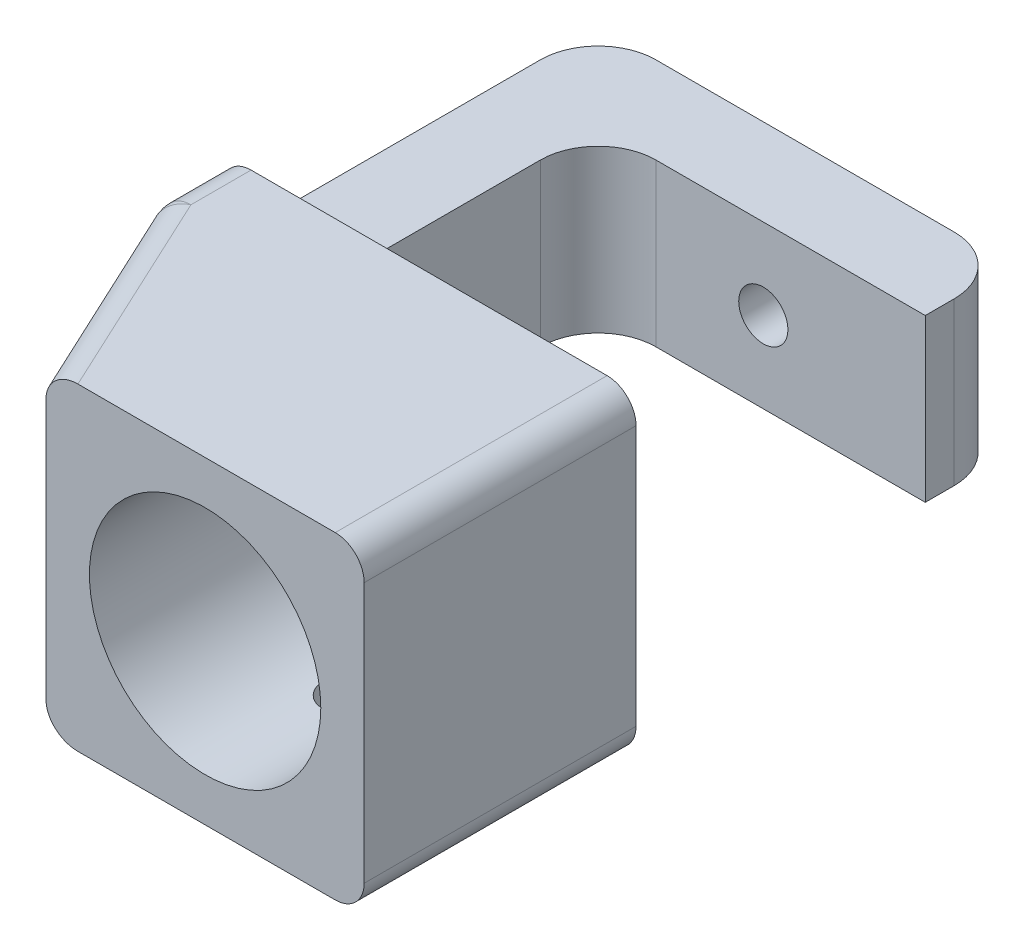
ISO-10303-21;
HEADER;
FILE_DESCRIPTION(('STEP AP214'),'2;1');
FILE_NAME('part.step','',(''),(''),'','','');
FILE_SCHEMA(('AUTOMOTIVE_DESIGN { 1 0 10303 214 1 1 1 1 }'));
ENDSEC;
DATA;
#1=APPLICATION_CONTEXT('core data for automotive mechanical design processes');
#2=APPLICATION_PROTOCOL_DEFINITION('international standard','automotive_design',2000,#1);
#3=PRODUCT_CONTEXT('',#1,'mechanical');
#4=PRODUCT('Part','Part','',(#3));
#5=PRODUCT_RELATED_PRODUCT_CATEGORY('part','',(#4));
#6=PRODUCT_DEFINITION_FORMATION('','',#4);
#7=PRODUCT_DEFINITION_CONTEXT('part definition',#1,'design');
#8=PRODUCT_DEFINITION('design','',#6,#7);
#9=PRODUCT_DEFINITION_SHAPE('','',#8);
#10=(LENGTH_UNIT() NAMED_UNIT(*) SI_UNIT(.MILLI.,.METRE.));
#11=(NAMED_UNIT(*) PLANE_ANGLE_UNIT() SI_UNIT($,.RADIAN.));
#12=(NAMED_UNIT(*) SI_UNIT($,.STERADIAN.) SOLID_ANGLE_UNIT());
#13=UNCERTAINTY_MEASURE_WITH_UNIT(LENGTH_MEASURE(1.E-05),#10,'distance_accuracy_value','');
#14=(GEOMETRIC_REPRESENTATION_CONTEXT(3) GLOBAL_UNCERTAINTY_ASSIGNED_CONTEXT((#13)) GLOBAL_UNIT_ASSIGNED_CONTEXT((#10,
#11,#12)) REPRESENTATION_CONTEXT('',''));
#15=CARTESIAN_POINT('',(0.,0.,0.));
#16=DIRECTION('',(0.,0.,1.));
#17=DIRECTION('',(1.,0.,0.));
#18=AXIS2_PLACEMENT_3D('',#15,#16,#17);
#19=CARTESIAN_POINT('',(8.9715256437763,41.5,65.2434779334417));
#20=DIRECTION('',(0.,1.,0.));
#21=DIRECTION('',(0.,0.,1.));
#22=AXIS2_PLACEMENT_3D('',#19,#20,#21);
#23=PLANE('',#22);
#24=DIRECTION('',(0.,0.,-1.));
#25=VECTOR('',#24,1.);
#26=CARTESIAN_POINT('',(67.55,41.5,65.2434779334417));
#27=LINE('',#26,#25);
#28=CARTESIAN_POINT('',(67.55,41.5,15.));
#29=VERTEX_POINT('',#28);
#30=CARTESIAN_POINT('',(67.55,41.5,10.));
#31=VERTEX_POINT('',#30);
#32=EDGE_CURVE('E229',#29,#31,#27,.T.);
#33=ORIENTED_EDGE('',*,*,#32,.T.);
#34=CARTESIAN_POINT('',(57.55,41.5,10.));
#35=DIRECTION('',(0.,1.,0.));
#36=DIRECTION('',(0.,0.,1.));
#37=AXIS2_PLACEMENT_3D('',#34,#35,#36);
#38=CIRCLE('',#37,10.);
#39=CARTESIAN_POINT('',(57.55,41.5,0.));
#40=VERTEX_POINT('',#39);
#41=EDGE_CURVE('E12',#31,#40,#38,.T.);
#42=ORIENTED_EDGE('',*,*,#41,.T.);
#43=DIRECTION('',(1.,0.,0.));
#44=VECTOR('',#43,1.);
#45=CARTESIAN_POINT('',(8.9715256437763,41.5,0.));
#46=LINE('',#45,#44);
#47=CARTESIAN_POINT('',(6.,41.5,0.));
#48=VERTEX_POINT('',#47);
#49=EDGE_CURVE('E204',#40,#48,#46,.F.);
#50=ORIENTED_EDGE('',*,*,#49,.T.);
#51=CARTESIAN_POINT('',(6.,41.5,10.));
#52=DIRECTION('',(0.,1.,0.));
#53=DIRECTION('',(0.,0.,1.));
#54=AXIS2_PLACEMENT_3D('',#51,#52,#53);
#55=CIRCLE('',#54,10.);
#56=CARTESIAN_POINT('',(-4.,41.5,10.));
#57=VERTEX_POINT('',#56);
#58=EDGE_CURVE('E199',#48,#57,#55,.T.);
#59=ORIENTED_EDGE('',*,*,#58,.T.);
#60=DIRECTION('',(0.,0.,1.));
#61=VECTOR('',#60,1.);
#62=CARTESIAN_POINT('',(-3.99999999999999,41.5,65.2434779334417));
#63=LINE('',#62,#61);
#64=CARTESIAN_POINT('',(-3.99999999999999,41.5,65.));
#65=VERTEX_POINT('',#64);
#66=EDGE_CURVE('E197',#57,#65,#63,.T.);
#67=ORIENTED_EDGE('',*,*,#66,.T.);
#68=DIRECTION('',(-1.,0.,0.));
#69=VECTOR('',#68,1.);
#70=CARTESIAN_POINT('',(17.8187221300504,41.5,65.));
#71=LINE('',#70,#69);
#72=CARTESIAN_POINT('',(21.,41.5,65.));
#73=VERTEX_POINT('',#72);
#74=EDGE_CURVE('E184',#73,#65,#71,.T.);
#75=ORIENTED_EDGE('',*,*,#74,.F.);
#76=CARTESIAN_POINT('',(21.,41.5,55.));
#77=DIRECTION('',(0.,1.,0.));
#78=DIRECTION('',(0.,0.,1.));
#79=AXIS2_PLACEMENT_3D('',#76,#77,#78);
#80=CIRCLE('',#79,10.);
#81=CARTESIAN_POINT('',(11.,41.5,55.));
#82=VERTEX_POINT('',#81);
#83=EDGE_CURVE('E267',#73,#82,#80,.F.);
#84=ORIENTED_EDGE('',*,*,#83,.T.);
#85=DIRECTION('',(0.,0.,1.));
#86=VECTOR('',#85,1.);
#87=CARTESIAN_POINT('',(11.,41.5,65.2434779334417));
#88=LINE('',#87,#86);
#89=CARTESIAN_POINT('',(11.,41.5,25.));
#90=VERTEX_POINT('',#89);
#91=EDGE_CURVE('E232',#82,#90,#88,.F.);
#92=ORIENTED_EDGE('',*,*,#91,.T.);
#93=CARTESIAN_POINT('',(21.,41.5,25.));
#94=DIRECTION('',(0.,1.,0.));
#95=DIRECTION('',(0.,0.,1.));
#96=AXIS2_PLACEMENT_3D('',#93,#94,#95);
#97=CIRCLE('',#96,10.);
#98=CARTESIAN_POINT('',(21.,41.5,15.));
#99=VERTEX_POINT('',#98);
#100=EDGE_CURVE('E272',#90,#99,#97,.F.);
#101=ORIENTED_EDGE('',*,*,#100,.T.);
#102=DIRECTION('',(1.,0.,0.));
#103=VECTOR('',#102,1.);
#104=CARTESIAN_POINT('',(8.9715256437763,41.5,15.));
#105=LINE('',#104,#103);
#106=EDGE_CURVE('E230',#99,#29,#105,.T.);
#107=ORIENTED_EDGE('',*,*,#106,.T.);
#108=EDGE_LOOP('',(#33,#42,#50,#59,#67,#75,#84,#92,#101,#107));
#109=FACE_BOUND('',#108,.T.);
#110=ADVANCED_FACE('F42',(#109),#23,.T.);
#111=CARTESIAN_POINT('',(8.9715256437763,13.5278717350853,65.2434779334417));
#112=DIRECTION('',(0.,-1.,0.));
#113=DIRECTION('',(0.,0.,-1.));
#114=AXIS2_PLACEMENT_3D('',#111,#112,#113);
#115=PLANE('',#114);
#116=DIRECTION('',(1.,0.,0.));
#117=VECTOR('',#116,1.);
#118=CARTESIAN_POINT('',(8.9715256437763,13.5278717350853,0.));
#119=LINE('',#118,#117);
#120=CARTESIAN_POINT('',(6.,13.5278717350853,0.));
#121=VERTEX_POINT('',#120);
#122=CARTESIAN_POINT('',(57.55,13.5278717350853,0.));
#123=VERTEX_POINT('',#122);
#124=EDGE_CURVE('E238',#121,#123,#119,.T.);
#125=ORIENTED_EDGE('',*,*,#124,.T.);
#126=CARTESIAN_POINT('',(57.55,13.5278717350853,10.));
#127=DIRECTION('',(0.,-1.,0.));
#128=DIRECTION('',(0.,0.,-1.));
#129=AXIS2_PLACEMENT_3D('',#126,#127,#128);
#130=CIRCLE('',#129,10.);
#131=CARTESIAN_POINT('',(67.55,13.5278717350853,10.));
#132=VERTEX_POINT('',#131);
#133=EDGE_CURVE('E64',#123,#132,#130,.T.);
#134=ORIENTED_EDGE('',*,*,#133,.T.);
#135=DIRECTION('',(0.,0.,1.));
#136=VECTOR('',#135,1.);
#137=CARTESIAN_POINT('',(67.55,13.5278717350853,65.2434779334417));
#138=LINE('',#137,#136);
#139=CARTESIAN_POINT('',(67.55,13.5278717350853,15.));
#140=VERTEX_POINT('',#139);
#141=EDGE_CURVE('E237',#132,#140,#138,.T.);
#142=ORIENTED_EDGE('',*,*,#141,.T.);
#143=DIRECTION('',(1.,0.,0.));
#144=VECTOR('',#143,1.);
#145=CARTESIAN_POINT('',(8.9715256437763,13.5278717350853,15.));
#146=LINE('',#145,#144);
#147=CARTESIAN_POINT('',(21.,13.5278717350853,15.));
#148=VERTEX_POINT('',#147);
#149=EDGE_CURVE('E233',#140,#148,#146,.F.);
#150=ORIENTED_EDGE('',*,*,#149,.T.);
#151=CARTESIAN_POINT('',(21.,13.5278717350853,25.));
#152=DIRECTION('',(0.,-1.,0.));
#153=DIRECTION('',(0.,0.,-1.));
#154=AXIS2_PLACEMENT_3D('',#151,#152,#153);
#155=CIRCLE('',#154,10.);
#156=CARTESIAN_POINT('',(11.,13.5278717350853,25.));
#157=VERTEX_POINT('',#156);
#158=EDGE_CURVE('E274',#148,#157,#155,.F.);
#159=ORIENTED_EDGE('',*,*,#158,.T.);
#160=DIRECTION('',(0.,0.,-1.));
#161=VECTOR('',#160,1.);
#162=CARTESIAN_POINT('',(11.,13.5278717350853,65.2434779334417));
#163=LINE('',#162,#161);
#164=CARTESIAN_POINT('',(11.,13.5278717350853,55.));
#165=VERTEX_POINT('',#164);
#166=EDGE_CURVE('E236',#157,#165,#163,.F.);
#167=ORIENTED_EDGE('',*,*,#166,.T.);
#168=CARTESIAN_POINT('',(21.,13.5278717350853,55.));
#169=DIRECTION('',(0.,-1.,0.));
#170=DIRECTION('',(0.,0.,-1.));
#171=AXIS2_PLACEMENT_3D('',#168,#169,#170);
#172=CIRCLE('',#171,10.);
#173=CARTESIAN_POINT('',(21.,13.5278717350853,65.));
#174=VERTEX_POINT('',#173);
#175=EDGE_CURVE('E269',#165,#174,#172,.F.);
#176=ORIENTED_EDGE('',*,*,#175,.T.);
#177=DIRECTION('',(1.,0.,0.));
#178=VECTOR('',#177,1.);
#179=CARTESIAN_POINT('',(17.8187221300509,13.5278717350853,65.));
#180=LINE('',#179,#178);
#181=CARTESIAN_POINT('',(-3.99999999999999,13.5278717350853,65.));
#182=VERTEX_POINT('',#181);
#183=EDGE_CURVE('E194',#182,#174,#180,.T.);
#184=ORIENTED_EDGE('',*,*,#183,.F.);
#185=DIRECTION('',(0.,0.,-1.));
#186=VECTOR('',#185,1.);
#187=CARTESIAN_POINT('',(-3.99999999999999,13.5278717350853,65.2434779334417));
#188=LINE('',#187,#186);
#189=CARTESIAN_POINT('',(-4.,13.5278717350853,10.));
#190=VERTEX_POINT('',#189);
#191=EDGE_CURVE('E240',#182,#190,#188,.T.);
#192=ORIENTED_EDGE('',*,*,#191,.T.);
#193=CARTESIAN_POINT('',(6.,13.5278717350853,10.));
#194=DIRECTION('',(0.,-1.,0.));
#195=DIRECTION('',(0.,0.,-1.));
#196=AXIS2_PLACEMENT_3D('',#193,#194,#195);
#197=CIRCLE('',#196,10.);
#198=EDGE_CURVE('E259',#190,#121,#197,.T.);
#199=ORIENTED_EDGE('',*,*,#198,.T.);
#200=EDGE_LOOP('',(#125,#134,#142,#150,#159,#167,#176,#184,#192,#199));
#201=FACE_BOUND('',#200,.T.);
#202=ADVANCED_FACE('F365',(#201),#115,.T.);
#203=CARTESIAN_POINT('',(11.,55.,23.4626806735751));
#204=DIRECTION('',(1.,0.,0.));
#205=DIRECTION('',(0.,0.,-1.));
#206=AXIS2_PLACEMENT_3D('',#203,#204,#205);
#207=PLANE('',#206);
#208=ORIENTED_EDGE('',*,*,#91,.F.);
#209=DIRECTION('',(0.,1.,0.));
#210=VECTOR('',#209,1.);
#211=CARTESIAN_POINT('',(11.,13.5278717350853,55.));
#212=LINE('',#211,#210);
#213=EDGE_CURVE('E254',#82,#165,#212,.F.);
#214=ORIENTED_EDGE('',*,*,#213,.T.);
#215=ORIENTED_EDGE('',*,*,#166,.F.);
#216=DIRECTION('',(0.,1.,0.));
#217=VECTOR('',#216,1.);
#218=CARTESIAN_POINT('',(11.,41.5,25.));
#219=LINE('',#218,#217);
#220=EDGE_CURVE('E251',#157,#90,#219,.T.);
#221=ORIENTED_EDGE('',*,*,#220,.T.);
#222=EDGE_LOOP('',(#208,#214,#215,#221));
#223=FACE_BOUND('',#222,.T.);
#224=ADVANCED_FACE('F393',(#223),#207,.T.);
#225=CARTESIAN_POINT('',(48.,55.,15.));
#226=DIRECTION('',(0.,0.,1.));
#227=DIRECTION('',(1.,0.,0.));
#228=AXIS2_PLACEMENT_3D('',#225,#226,#227);
#229=PLANE('',#228);
#230=CARTESIAN_POINT('',(39.55,27.5139358675427,15.));
#231=DIRECTION('',(0.,0.,1.));
#232=DIRECTION('',(1.,0.,0.));
#233=AXIS2_PLACEMENT_3D('',#230,#231,#232);
#234=CIRCLE('',#233,4.24999999999999);
#235=CARTESIAN_POINT('',(43.8,27.5139358675427,15.));
#236=VERTEX_POINT('',#235);
#237=EDGE_CURVE('E532',#236,#236,#234,.T.);
#238=ORIENTED_EDGE('',*,*,#237,.F.);
#239=EDGE_LOOP('',(#238));
#240=FACE_BOUND('',#239,.T.);
#241=ORIENTED_EDGE('',*,*,#106,.F.);
#242=DIRECTION('',(0.,1.,0.));
#243=VECTOR('',#242,1.);
#244=CARTESIAN_POINT('',(21.,13.5278717350853,15.));
#245=LINE('',#244,#243);
#246=EDGE_CURVE('E265',#99,#148,#245,.F.);
#247=ORIENTED_EDGE('',*,*,#246,.T.);
#248=ORIENTED_EDGE('',*,*,#149,.F.);
#249=DIRECTION('',(0.,-1.,0.));
#250=VECTOR('',#249,1.);
#251=CARTESIAN_POINT('',(67.55,55.,15.));
#252=LINE('',#251,#250);
#253=EDGE_CURVE('E350',#29,#140,#252,.T.);
#254=ORIENTED_EDGE('',*,*,#253,.F.);
#255=EDGE_LOOP('',(#241,#247,#248,#254));
#256=FACE_BOUND('',#255,.T.);
#257=ADVANCED_FACE('F412',(#240,#256),#229,.T.);
#258=CARTESIAN_POINT('',(67.55,55.,0.));
#259=DIRECTION('',(1.,0.,0.));
#260=DIRECTION('',(0.,0.,-1.));
#261=AXIS2_PLACEMENT_3D('',#258,#259,#260);
#262=PLANE('',#261);
#263=ORIENTED_EDGE('',*,*,#141,.F.);
#264=DIRECTION('',(0.,-1.,0.));
#265=VECTOR('',#264,1.);
#266=CARTESIAN_POINT('',(67.55,55.,10.));
#267=LINE('',#266,#265);
#268=EDGE_CURVE('E50',#132,#31,#267,.F.);
#269=ORIENTED_EDGE('',*,*,#268,.T.);
#270=ORIENTED_EDGE('',*,*,#32,.F.);
#271=ORIENTED_EDGE('',*,*,#253,.T.);
#272=EDGE_LOOP('',(#263,#269,#270,#271));
#273=FACE_BOUND('',#272,.T.);
#274=ADVANCED_FACE('F416',(#273),#262,.T.);
#275=CARTESIAN_POINT('',(3.,55.,0.));
#276=DIRECTION('',(0.,0.,-1.));
#277=DIRECTION('',(-1.,0.,0.));
#278=AXIS2_PLACEMENT_3D('',#275,#276,#277);
#279=PLANE('',#278);
#280=CARTESIAN_POINT('',(39.55,27.5139358675427,0.));
#281=DIRECTION('',(0.,0.,-1.));
#282=DIRECTION('',(-1.,0.,0.));
#283=AXIS2_PLACEMENT_3D('',#280,#281,#282);
#284=CIRCLE('',#283,4.24999999999999);
#285=CARTESIAN_POINT('',(35.3,27.5139358675427,0.));
#286=VERTEX_POINT('',#285);
#287=EDGE_CURVE('E535',#286,#286,#284,.T.);
#288=ORIENTED_EDGE('',*,*,#287,.F.);
#289=EDGE_LOOP('',(#288));
#290=FACE_BOUND('',#289,.T.);
#291=ORIENTED_EDGE('',*,*,#49,.F.);
#292=DIRECTION('',(0.,-1.,0.));
#293=VECTOR('',#292,1.);
#294=CARTESIAN_POINT('',(57.55,55.,0.));
#295=LINE('',#294,#293);
#296=EDGE_CURVE('E332',#40,#123,#295,.T.);
#297=ORIENTED_EDGE('',*,*,#296,.T.);
#298=ORIENTED_EDGE('',*,*,#124,.F.);
#299=DIRECTION('',(0.,-1.,0.));
#300=VECTOR('',#299,1.);
#301=CARTESIAN_POINT('',(6.,55.,0.));
#302=LINE('',#301,#300);
#303=EDGE_CURVE('E261',#121,#48,#302,.F.);
#304=ORIENTED_EDGE('',*,*,#303,.T.);
#305=EDGE_LOOP('',(#291,#297,#298,#304));
#306=FACE_BOUND('',#305,.T.);
#307=ADVANCED_FACE('F361',(#290,#306),#279,.T.);
#308=CARTESIAN_POINT('',(-4.,55.,3.));
#309=DIRECTION('',(-1.,0.,0.));
#310=DIRECTION('',(0.,0.,1.));
#311=AXIS2_PLACEMENT_3D('',#308,#309,#310);
#312=PLANE('',#311);
#313=DIRECTION('',(0.,-1.,0.));
#314=VECTOR('',#313,1.);
#315=CARTESIAN_POINT('',(-3.99999999999999,55.,75.3999371523523));
#316=LINE('',#315,#314);
#317=CARTESIAN_POINT('',(-3.99999999999999,5.,75.3999371523523));
#318=VERTEX_POINT('',#317);
#319=CARTESIAN_POINT('',(-3.99999999999999,50.,75.3999371523523));
#320=VERTEX_POINT('',#319);
#321=EDGE_CURVE('E313',#318,#320,#316,.F.);
#322=ORIENTED_EDGE('',*,*,#321,.T.);
#323=DIRECTION('',(0.,0.,1.));
#324=VECTOR('',#323,1.);
#325=CARTESIAN_POINT('',(-3.99999999999999,50.,65.));
#326=LINE('',#325,#324);
#327=CARTESIAN_POINT('',(-3.99999999999999,50.,65.));
#328=VERTEX_POINT('',#327);
#329=EDGE_CURVE('E208',#320,#328,#326,.F.);
#330=ORIENTED_EDGE('',*,*,#329,.T.);
#331=DIRECTION('',(0.,1.,0.));
#332=VECTOR('',#331,1.);
#333=CARTESIAN_POINT('',(-3.99999999999999,41.5,65.));
#334=LINE('',#333,#332);
#335=EDGE_CURVE('E188',#65,#328,#334,.T.);
#336=ORIENTED_EDGE('',*,*,#335,.F.);
#337=ORIENTED_EDGE('',*,*,#66,.F.);
#338=DIRECTION('',(0.,-1.,0.));
#339=VECTOR('',#338,1.);
#340=CARTESIAN_POINT('',(-4.,55.,10.));
#341=LINE('',#340,#339);
#342=EDGE_CURVE('E257',#57,#190,#341,.T.);
#343=ORIENTED_EDGE('',*,*,#342,.T.);
#344=ORIENTED_EDGE('',*,*,#191,.F.);
#345=DIRECTION('',(0.,-1.,0.));
#346=VECTOR('',#345,1.);
#347=CARTESIAN_POINT('',(-3.99999999999999,55.,65.));
#348=LINE('',#347,#346);
#349=CARTESIAN_POINT('',(-3.99999999999999,5.,65.));
#350=VERTEX_POINT('',#349);
#351=EDGE_CURVE('E217',#182,#350,#348,.T.);
#352=ORIENTED_EDGE('',*,*,#351,.T.);
#353=DIRECTION('',(0.,0.,-1.));
#354=VECTOR('',#353,1.);
#355=CARTESIAN_POINT('',(-4.,5.,3.));
#356=LINE('',#355,#354);
#357=EDGE_CURVE('E311',#350,#318,#356,.F.);
#358=ORIENTED_EDGE('',*,*,#357,.T.);
#359=EDGE_LOOP('',(#322,#330,#336,#337,#343,#344,#352,#358));
#360=FACE_BOUND('',#359,.T.);
#361=ADVANCED_FACE('F206',(#360),#312,.T.);
#362=CARTESIAN_POINT('',(60.,0.,70.));
#363=DIRECTION('',(0.,-1.,0.));
#364=DIRECTION('',(0.,0.,-1.));
#365=AXIS2_PLACEMENT_3D('',#362,#363,#364);
#366=PLANE('',#365);
#367=CARTESIAN_POINT('',(40.05,0.,88.5));
#368=DIRECTION('',(0.,-1.,0.));
#369=DIRECTION('',(0.,0.,-1.));
#370=AXIS2_PLACEMENT_3D('',#367,#368,#369);
#371=CIRCLE('',#370,3.39999999999999);
#372=CARTESIAN_POINT('',(40.05,0.,85.1));
#373=VERTEX_POINT('',#372);
#374=EDGE_CURVE('E530',#373,#373,#371,.T.);
#375=ORIENTED_EDGE('',*,*,#374,.F.);
#376=EDGE_LOOP('',(#375));
#377=FACE_BOUND('',#376,.T.);
#378=DIRECTION('',(0.4226182617407,0.,0.90630778703665));
#379=VECTOR('',#378,1.);
#380=CARTESIAN_POINT('',(0.531538935183259,0.,74.3953191568635));
#381=LINE('',#380,#379);
#382=CARTESIAN_POINT('',(18.0668895948125,0.,112.));
#383=VERTEX_POINT('',#382);
#384=CARTESIAN_POINT('',(1.00000000000001,0.,75.3999371523522));
#385=VERTEX_POINT('',#384);
#386=EDGE_CURVE('E324',#383,#385,#381,.F.);
#387=ORIENTED_EDGE('',*,*,#386,.T.);
#388=DIRECTION('',(0.,0.,-1.));
#389=VECTOR('',#388,1.);
#390=CARTESIAN_POINT('',(1.00000000000001,0.,70.));
#391=LINE('',#390,#389);
#392=CARTESIAN_POINT('',(1.00000000000001,0.,65.));
#393=VERTEX_POINT('',#392);
#394=EDGE_CURVE('E326',#385,#393,#391,.T.);
#395=ORIENTED_EDGE('',*,*,#394,.T.);
#396=DIRECTION('',(1.,0.,0.));
#397=VECTOR('',#396,1.);
#398=CARTESIAN_POINT('',(60.,0.,65.));
#399=LINE('',#398,#397);
#400=CARTESIAN_POINT('',(62.55,0.,65.));
#401=VERTEX_POINT('',#400);
#402=EDGE_CURVE('E203',#393,#401,#399,.T.);
#403=ORIENTED_EDGE('',*,*,#402,.T.);
#404=DIRECTION('',(0.,0.,-1.));
#405=VECTOR('',#404,1.);
#406=CARTESIAN_POINT('',(62.55,0.,70.));
#407=LINE('',#406,#405);
#408=CARTESIAN_POINT('',(62.55,0.,112.));
#409=VERTEX_POINT('',#408);
#410=EDGE_CURVE('E298',#401,#409,#407,.F.);
#411=ORIENTED_EDGE('',*,*,#410,.T.);
#412=DIRECTION('',(1.,0.,0.));
#413=VECTOR('',#412,1.);
#414=CARTESIAN_POINT('',(65.,0.,112.));
#415=LINE('',#414,#413);
#416=EDGE_CURVE('E220',#383,#409,#415,.T.);
#417=ORIENTED_EDGE('',*,*,#416,.F.);
#418=EDGE_LOOP('',(#387,#395,#403,#411,#417));
#419=FACE_BOUND('',#418,.T.);
#420=ADVANCED_FACE('F408',(#377,#419),#366,.T.);
#421=CARTESIAN_POINT('',(67.55,55.,70.));
#422=DIRECTION('',(1.,0.,0.));
#423=DIRECTION('',(0.,0.,-1.));
#424=AXIS2_PLACEMENT_3D('',#421,#422,#423);
#425=PLANE('',#424);
#426=DIRECTION('',(0.,1.,0.));
#427=VECTOR('',#426,1.);
#428=CARTESIAN_POINT('',(67.55,41.5,65.));
#429=LINE('',#428,#427);
#430=CARTESIAN_POINT('',(67.55,5.,65.));
#431=VERTEX_POINT('',#430);
#432=CARTESIAN_POINT('',(67.55,50.,65.));
#433=VERTEX_POINT('',#432);
#434=EDGE_CURVE('E256',#431,#433,#429,.T.);
#435=ORIENTED_EDGE('',*,*,#434,.T.);
#436=DIRECTION('',(0.,0.,1.));
#437=VECTOR('',#436,1.);
#438=CARTESIAN_POINT('',(67.55,50.,112.));
#439=LINE('',#438,#437);
#440=CARTESIAN_POINT('',(67.55,50.,112.));
#441=VERTEX_POINT('',#440);
#442=EDGE_CURVE('E283',#433,#441,#439,.T.);
#443=ORIENTED_EDGE('',*,*,#442,.T.);
#444=DIRECTION('',(0.,1.,0.));
#445=VECTOR('',#444,1.);
#446=CARTESIAN_POINT('',(67.55,55.,112.));
#447=LINE('',#446,#445);
#448=CARTESIAN_POINT('',(67.55,5.,112.));
#449=VERTEX_POINT('',#448);
#450=EDGE_CURVE('E225',#449,#441,#447,.T.);
#451=ORIENTED_EDGE('',*,*,#450,.F.);
#452=DIRECTION('',(0.,0.,-1.));
#453=VECTOR('',#452,1.);
#454=CARTESIAN_POINT('',(67.55,5.,70.));
#455=LINE('',#454,#453);
#456=EDGE_CURVE('E276',#449,#431,#455,.T.);
#457=ORIENTED_EDGE('',*,*,#456,.T.);
#458=EDGE_LOOP('',(#435,#443,#451,#457));
#459=FACE_BOUND('',#458,.T.);
#460=ADVANCED_FACE('F436',(#459),#425,.T.);
#461=CARTESIAN_POINT('',(60.,55.,70.));
#462=DIRECTION('',(0.,-1.,0.));
#463=DIRECTION('',(0.,0.,-1.));
#464=AXIS2_PLACEMENT_3D('',#461,#462,#463);
#465=PLANE('',#464);
#466=DIRECTION('',(1.,0.,0.));
#467=VECTOR('',#466,1.);
#468=CARTESIAN_POINT('',(60.,55.,65.));
#469=LINE('',#468,#467);
#470=CARTESIAN_POINT('',(1.00000000000001,55.,65.));
#471=VERTEX_POINT('',#470);
#472=CARTESIAN_POINT('',(62.55,55.,65.));
#473=VERTEX_POINT('',#472);
#474=EDGE_CURVE('E218',#471,#473,#469,.T.);
#475=ORIENTED_EDGE('',*,*,#474,.F.);
#476=DIRECTION('',(0.,0.,1.));
#477=VECTOR('',#476,1.);
#478=CARTESIAN_POINT('',(1.00000000000001,55.,76.508410465567));
#479=LINE('',#478,#477);
#480=CARTESIAN_POINT('',(1.00000000000001,55.,75.3999371523523));
#481=VERTEX_POINT('',#480);
#482=EDGE_CURVE('E318',#471,#481,#479,.T.);
#483=ORIENTED_EDGE('',*,*,#482,.T.);
#484=DIRECTION('',(-0.4226182617407,0.,-0.90630778703665));
#485=VECTOR('',#484,1.);
#486=CARTESIAN_POINT('',(9.46946958987154,55.,93.562773300877));
#487=LINE('',#486,#485);
#488=CARTESIAN_POINT('',(18.0668895948124,55.,112.));
#489=VERTEX_POINT('',#488);
#490=EDGE_CURVE('E316',#481,#489,#487,.F.);
#491=ORIENTED_EDGE('',*,*,#490,.T.);
#492=DIRECTION('',(1.,0.,0.));
#493=VECTOR('',#492,1.);
#494=CARTESIAN_POINT('',(65.,55.,112.));
#495=LINE('',#494,#493);
#496=CARTESIAN_POINT('',(62.55,55.,112.));
#497=VERTEX_POINT('',#496);
#498=EDGE_CURVE('E221',#497,#489,#495,.F.);
#499=ORIENTED_EDGE('',*,*,#498,.F.);
#500=DIRECTION('',(0.,0.,1.));
#501=VECTOR('',#500,1.);
#502=CARTESIAN_POINT('',(62.55,55.,65.));
#503=LINE('',#502,#501);
#504=EDGE_CURVE('E290',#497,#473,#503,.F.);
#505=ORIENTED_EDGE('',*,*,#504,.T.);
#506=EDGE_LOOP('',(#475,#483,#491,#499,#505));
#507=FACE_BOUND('',#506,.T.);
#508=ADVANCED_FACE('F420',(#507),#465,.F.);
#509=CARTESIAN_POINT('',(65.,55.,112.));
#510=DIRECTION('',(0.,0.,1.));
#511=DIRECTION('',(1.,0.,0.));
#512=AXIS2_PLACEMENT_3D('',#509,#510,#511);
#513=PLANE('',#512);
#514=DIRECTION('',(0.,-1.,0.));
#515=VECTOR('',#514,1.);
#516=CARTESIAN_POINT('',(12.55,94.1606362011737,112.));
#517=LINE('',#516,#515);
#518=CARTESIAN_POINT('',(12.55,50.,112.));
#519=VERTEX_POINT('',#518);
#520=CARTESIAN_POINT('',(12.55,5.00000000000003,112.));
#521=VERTEX_POINT('',#520);
#522=EDGE_CURVE('E209',#519,#521,#517,.T.);
#523=ORIENTED_EDGE('',*,*,#522,.T.);
#524=CARTESIAN_POINT('',(18.0668895948124,5.,112.));
#525=DIRECTION('',(0.,0.,1.));
#526=DIRECTION('',(-1.,0.,0.));
#527=AXIS2_PLACEMENT_3D('',#524,#525,#526);
#528=ELLIPSE('',#527,5.51688959481246,5.);
#529=EDGE_CURVE('E330',#521,#383,#528,.T.);
#530=ORIENTED_EDGE('',*,*,#529,.T.);
#531=ORIENTED_EDGE('',*,*,#416,.T.);
#532=CARTESIAN_POINT('',(62.55,5.,112.));
#533=DIRECTION('',(0.,0.,1.));
#534=DIRECTION('',(1.,0.,0.));
#535=AXIS2_PLACEMENT_3D('',#532,#533,#534);
#536=CIRCLE('',#535,5.);
#537=EDGE_CURVE('E286',#409,#449,#536,.T.);
#538=ORIENTED_EDGE('',*,*,#537,.T.);
#539=ORIENTED_EDGE('',*,*,#450,.T.);
#540=CARTESIAN_POINT('',(62.55,50.,112.));
#541=DIRECTION('',(0.,0.,1.));
#542=DIRECTION('',(1.,0.,0.));
#543=AXIS2_PLACEMENT_3D('',#540,#541,#542);
#544=CIRCLE('',#543,5.);
#545=EDGE_CURVE('E288',#441,#497,#544,.T.);
#546=ORIENTED_EDGE('',*,*,#545,.T.);
#547=ORIENTED_EDGE('',*,*,#498,.T.);
#548=CARTESIAN_POINT('',(18.0668895948124,50.,112.));
#549=DIRECTION('',(0.,0.,1.));
#550=DIRECTION('',(-1.,0.,0.));
#551=AXIS2_PLACEMENT_3D('',#548,#549,#550);
#552=ELLIPSE('',#551,5.51688959481246,5.);
#553=EDGE_CURVE('E328',#489,#519,#552,.T.);
#554=ORIENTED_EDGE('',*,*,#553,.T.);
#555=EDGE_LOOP('',(#523,#530,#531,#538,#539,#546,#547,#554));
#556=FACE_BOUND('',#555,.T.);
#557=CARTESIAN_POINT('',(40.0535204826612,27.5,112.));
#558=DIRECTION('',(0.,0.,1.));
#559=DIRECTION('',(1.,0.,0.));
#560=AXIS2_PLACEMENT_3D('',#557,#558,#559);
#561=CIRCLE('',#560,20.);
#562=CARTESIAN_POINT('',(60.0535204826612,27.5,112.));
#563=VERTEX_POINT('',#562);
#564=EDGE_CURVE('E224',#563,#563,#561,.F.);
#565=ORIENTED_EDGE('',*,*,#564,.T.);
#566=EDGE_LOOP('',(#565));
#567=FACE_BOUND('',#566,.T.);
#568=ADVANCED_FACE('F378',(#556,#567),#513,.T.);
#569=CARTESIAN_POINT('',(40.0535204826612,27.5,72.));
#570=DIRECTION('',(0.,0.,-1.));
#571=DIRECTION('',(-1.,0.,0.));
#572=AXIS2_PLACEMENT_3D('',#569,#570,#571);
#573=PLANE('',#572);
#574=CARTESIAN_POINT('',(40.0535204826612,27.5,72.));
#575=DIRECTION('',(0.,0.,-1.));
#576=DIRECTION('',(-1.,0.,0.));
#577=AXIS2_PLACEMENT_3D('',#574,#575,#576);
#578=CIRCLE('',#577,20.);
#579=CARTESIAN_POINT('',(20.0535204826612,27.5,72.));
#580=VERTEX_POINT('',#579);
#581=EDGE_CURVE('E302',#580,#580,#578,.F.);
#582=ORIENTED_EDGE('',*,*,#581,.T.);
#583=EDGE_LOOP('',(#582));
#584=FACE_BOUND('',#583,.T.);
#585=ADVANCED_FACE('F383',(#584),#573,.F.);
#586=CARTESIAN_POINT('',(40.0535204826612,27.5,67.));
#587=DIRECTION('',(0.,0.,1.));
#588=DIRECTION('',(1.,0.,0.));
#589=AXIS2_PLACEMENT_3D('',#586,#587,#588);
#590=CYLINDRICAL_SURFACE('',#589,20.);
#591=CARTESIAN_POINT('',(40.05,7.50000030984496,85.1));
#592=CARTESIAN_POINT('',(40.2395119032292,7.49997023347747,85.1000075473616));
#593=CARTESIAN_POINT('',(40.429126293747,7.50265520047854,85.1158982729714));
#594=CARTESIAN_POINT('',(40.8030341271204,7.51317160094451,85.1790131465231));
#595=CARTESIAN_POINT('',(40.9873225815016,7.52100770584413,85.22626573611));
#596=CARTESIAN_POINT('',(41.3451150488391,7.54094515000861,85.3506335900287));
#597=CARTESIAN_POINT('',(41.5186278770838,7.55304294734054,85.4277240610516));
#598=CARTESIAN_POINT('',(41.8502351481314,7.58017242131524,85.6095136159318));
#599=CARTESIAN_POINT('',(42.0083312720761,7.59520377752519,85.7142096848659));
#600=CARTESIAN_POINT('',(42.306206422883,7.6266995656651,85.9493425463023));
#601=CARTESIAN_POINT('',(42.4458103829775,7.64317553494791,86.0799995977943));
#602=CARTESIAN_POINT('',(42.7012259507549,7.67561421741151,86.3628714544627));
#603=CARTESIAN_POINT('',(42.8170360258991,7.69157689747607,86.5150876471743));
#604=CARTESIAN_POINT('',(43.0222842761063,7.72129167628524,86.8379678906175));
#605=CARTESIAN_POINT('',(43.1115480732515,7.73502889941722,87.0087442786296));
#606=CARTESIAN_POINT('',(43.2600551209858,7.75857592046759,87.3631397850055));
#607=CARTESIAN_POINT('',(43.3193004778933,7.76838599393403,87.5467580012613));
#608=CARTESIAN_POINT('',(43.4055365738782,7.78285262170636,87.9197696615264));
#609=CARTESIAN_POINT('',(43.4328295170312,7.78755742972946,88.1090913321492));
#610=CARTESIAN_POINT('',(43.4553231300398,7.7914262913617,88.4896810007746));
#611=CARTESIAN_POINT('',(43.4505261585924,7.79059075220166,88.6809488546956));
#612=CARTESIAN_POINT('',(43.4092223626693,7.78351748777326,89.0578366281029));
#613=CARTESIAN_POINT('',(43.3730560843464,7.7773377810789,89.243495116424));
#614=CARTESIAN_POINT('',(43.2705750205342,7.76036388992391,89.6060702280614));
#615=CARTESIAN_POINT('',(43.2042591639886,7.7495695415301,89.7829865405664));
#616=CARTESIAN_POINT('',(43.0430179664835,7.7245212385466,90.1240712132495));
#617=CARTESIAN_POINT('',(42.9479518115566,7.71025032481378,90.2881717096504));
#618=CARTESIAN_POINT('',(42.7320083742048,7.67986995586446,90.5982204895968));
#619=CARTESIAN_POINT('',(42.6111289301335,7.66376034672526,90.7441672512985));
#620=CARTESIAN_POINT('',(42.3451382790096,7.63126506948182,91.015735543113));
#621=CARTESIAN_POINT('',(42.199735129565,7.61487851751219,91.1410711973599));
#622=CARTESIAN_POINT('',(41.8898102234196,7.58386950702444,91.3656090981072));
#623=CARTESIAN_POINT('',(41.7252883370642,7.56924706047104,91.4648111673666));
#624=CARTESIAN_POINT('',(41.3815262665743,7.54339456525137,91.6342925339894));
#625=CARTESIAN_POINT('',(41.2022733260237,7.53216749704465,91.7045464401775));
#626=CARTESIAN_POINT('',(40.834278972913,7.5143972811258,91.8138709440333));
#627=CARTESIAN_POINT('',(40.6455383879406,7.5078537256366,91.8529442565202));
#628=CARTESIAN_POINT('',(40.2663938915878,7.50024515095376,91.8984090459826));
#629=CARTESIAN_POINT('',(40.0760383789061,7.49911425570912,91.9051934963737));
#630=CARTESIAN_POINT('',(39.696911820444,7.50228097662074,91.8869371287021));
#631=CARTESIAN_POINT('',(39.5081407116848,7.50657837596868,91.8618975817027));
#632=CARTESIAN_POINT('',(39.1387556454057,7.5200807733704,91.7810303239562));
#633=CARTESIAN_POINT('',(38.9580978740142,7.52925475495537,91.7253971213222));
#634=CARTESIAN_POINT('',(38.6086737778392,7.55148884133596,91.5851301258091));
#635=CARTESIAN_POINT('',(38.4399081453813,7.56454917215266,91.5004946461813));
#636=CARTESIAN_POINT('',(38.117351715444,7.59327396822518,91.3037275497061));
#637=CARTESIAN_POINT('',(37.9637126698144,7.60896124673434,91.1913505638025));
#638=CARTESIAN_POINT('',(37.6773330736527,7.64113451819093,90.9426271279028));
#639=CARTESIAN_POINT('',(37.5445941086399,7.65762057161099,90.8062788610594));
#640=CARTESIAN_POINT('',(37.3023196938644,7.68974944241313,90.5117171439116));
#641=CARTESIAN_POINT('',(37.1930503020654,7.7053812309558,90.3532834697426));
#642=CARTESIAN_POINT('',(37.0026771179441,7.73382539728464,90.0200776584854));
#643=CARTESIAN_POINT('',(36.9215724028992,7.74663786743144,89.8453060568936));
#644=CARTESIAN_POINT('',(36.7902275890832,7.76791047363783,89.4851233818054));
#645=CARTESIAN_POINT('',(36.7398559361092,7.77638913507717,89.2997614248252));
#646=CARTESIAN_POINT('',(36.6709938407992,7.78808089941111,88.923050618885));
#647=CARTESIAN_POINT('',(36.6525004976501,7.79129448140793,88.7317023162747));
#648=CARTESIAN_POINT('',(36.6480033728376,7.79207130276122,88.3511136969916));
#649=CARTESIAN_POINT('',(36.6615798601402,7.78970753906175,88.1618783584893));
#650=CARTESIAN_POINT('',(36.7199276850471,7.77975606730107,87.7884268598517));
#651=CARTESIAN_POINT('',(36.764698908762,7.77216837831197,87.6042106813944));
#652=CARTESIAN_POINT('',(36.8840019742526,7.75265152758483,87.2461987184613));
#653=CARTESIAN_POINT('',(36.958496258465,7.74072784641249,87.0723901007149));
#654=CARTESIAN_POINT('',(37.1350872417258,7.71387634879343,86.7396699952996));
#655=CARTESIAN_POINT('',(37.2371854032037,7.69894837319252,86.5807592975105));
#656=CARTESIAN_POINT('',(37.4675776890138,7.66753809478124,86.2802282455049));
#657=CARTESIAN_POINT('',(37.5961800699258,7.65103885742363,86.1388459411756));
#658=CARTESIAN_POINT('',(37.875281030831,7.61847663381996,85.8795250422508));
#659=CARTESIAN_POINT('',(38.0257846552228,7.6024137490909,85.7615918634181));
#660=CARTESIAN_POINT('',(38.345713038654,7.57239676644712,85.5517331346272));
#661=CARTESIAN_POINT('',(38.5152669249683,7.55845878194468,85.4600021068692));
#662=CARTESIAN_POINT('',(38.8675479097277,7.53441663801954,85.3064672011281));
#663=CARTESIAN_POINT('',(39.0502617968461,7.52430869573745,85.2446337770982));
#664=CARTESIAN_POINT('',(39.3697167983402,7.51124895318033,85.1659379563688));
#665=CARTESIAN_POINT('',(39.5045345106601,7.5070743852628,85.1412512692942));
#666=CARTESIAN_POINT('',(39.7762170084951,7.50146095349069,85.1082797153954));
#667=CARTESIAN_POINT('',(39.9130817563494,7.50002203936876,85.0999945471948));
#668=CARTESIAN_POINT('',(40.05,7.50000030984496,85.1));
#669=B_SPLINE_CURVE_WITH_KNOTS('',3,(#591,#592,#593,#594,#595,#596,#597,#598,#599,#600,#601,
#602,#603,#604,#605,#606,#607,#608,#609,#610,#611,#612,#613,#614,#615,#616,#617,#618,#619,#620,
#621,#622,#623,#624,#625,#626,#627,#628,#629,#630,#631,#632,#633,#634,#635,#636,#637,#638,#639,
#640,#641,#642,#643,#644,#645,#646,#647,#648,#649,#650,#651,#652,#653,#654,#655,#656,#657,#658,
#659,#660,#661,#662,#663,#664,#665,#666,#667,#668),.UNSPECIFIED.,.T.,.F.,(4,2,2,2,2,2,2,2,2,2,2,
2,2,2,2,2,2,2,2,2,2,2,2,2,2,2,2,2,2,2,2,2,2,2,2,2,2,2,4),(0.,0.568035220681899,1.13658628990823,
1.70466594147716,2.27268357636407,2.84574371202717,3.41884074631572,3.99562317392829,
4.5723651245636,5.14360705023179,5.71480698850658,6.27988249154589,6.84497807031862,
7.41288748933473,7.98084448466235,8.55611382142922,9.1313870596387,9.70716381611609,
10.2828904356255,10.8515919075958,11.4202706661143,11.9853749968639,12.5505121991997,
13.1208392552656,13.6912095565889,14.2677393611095,14.844250275752,15.4182757725141,
15.9922490322358,16.5587518151045,17.1252525297287,17.6910396790066,18.2568568090723,
18.8296691592376,19.4026136517067,19.9797071965423,20.5562292621194,20.9666299417538,
21.3770230802436),.UNSPECIFIED.);
#670=CARTESIAN_POINT('',(40.05,7.50000030984496,85.1));
#671=VERTEX_POINT('',#670);
#672=EDGE_CURVE('E336',#671,#671,#669,.T.);
#673=ORIENTED_EDGE('',*,*,#672,.T.);
#674=EDGE_LOOP('',(#673));
#675=FACE_BOUND('',#674,.T.);
#676=ORIENTED_EDGE('',*,*,#581,.F.);
#677=EDGE_LOOP('',(#676));
#678=FACE_BOUND('',#677,.T.);
#679=ORIENTED_EDGE('',*,*,#564,.F.);
#680=EDGE_LOOP('',(#679));
#681=FACE_BOUND('',#680,.T.);
#682=ADVANCED_FACE('F380',(#675,#678,#681),#590,.F.);
#683=CARTESIAN_POINT('',(21.,55.,55.));
#684=DIRECTION('',(0.,-1.,0.));
#685=DIRECTION('',(0.,0.,-1.));
#686=AXIS2_PLACEMENT_3D('',#683,#684,#685);
#687=CYLINDRICAL_SURFACE('',#686,10.);
#688=ORIENTED_EDGE('',*,*,#175,.F.);
#689=ORIENTED_EDGE('',*,*,#213,.F.);
#690=ORIENTED_EDGE('',*,*,#83,.F.);
#691=DIRECTION('',(0.,1.,0.));
#692=VECTOR('',#691,1.);
#693=CARTESIAN_POINT('',(21.,41.5,65.));
#694=LINE('',#693,#692);
#695=EDGE_CURVE('E191',#174,#73,#694,.T.);
#696=ORIENTED_EDGE('',*,*,#695,.F.);
#697=EDGE_LOOP('',(#688,#689,#690,#696));
#698=FACE_BOUND('',#697,.T.);
#699=ADVANCED_FACE('F382',(#698),#687,.F.);
#700=CARTESIAN_POINT('',(6.,55.,10.));
#701=DIRECTION('',(0.,-1.,0.));
#702=DIRECTION('',(0.,0.,-1.));
#703=AXIS2_PLACEMENT_3D('',#700,#701,#702);
#704=CYLINDRICAL_SURFACE('',#703,10.);
#705=ORIENTED_EDGE('',*,*,#58,.F.);
#706=ORIENTED_EDGE('',*,*,#303,.F.);
#707=ORIENTED_EDGE('',*,*,#198,.F.);
#708=ORIENTED_EDGE('',*,*,#342,.F.);
#709=EDGE_LOOP('',(#705,#706,#707,#708));
#710=FACE_BOUND('',#709,.T.);
#711=ADVANCED_FACE('F370',(#710),#704,.T.);
#712=CARTESIAN_POINT('',(21.,55.,25.));
#713=DIRECTION('',(0.,-1.,0.));
#714=DIRECTION('',(0.,0.,-1.));
#715=AXIS2_PLACEMENT_3D('',#712,#713,#714);
#716=CYLINDRICAL_SURFACE('',#715,10.);
#717=ORIENTED_EDGE('',*,*,#158,.F.);
#718=ORIENTED_EDGE('',*,*,#246,.F.);
#719=ORIENTED_EDGE('',*,*,#100,.F.);
#720=ORIENTED_EDGE('',*,*,#220,.F.);
#721=EDGE_LOOP('',(#717,#718,#719,#720));
#722=FACE_BOUND('',#721,.T.);
#723=ADVANCED_FACE('F429',(#722),#716,.F.);
#724=CARTESIAN_POINT('',(6.00000000000001,41.5,65.));
#725=DIRECTION('',(0.,0.,1.));
#726=DIRECTION('',(1.,0.,0.));
#727=AXIS2_PLACEMENT_3D('',#724,#725,#726);
#728=PLANE('',#727);
#729=ORIENTED_EDGE('',*,*,#335,.T.);
#730=CARTESIAN_POINT('',(1.00000000000001,50.,65.));
#731=DIRECTION('',(0.,0.,1.));
#732=DIRECTION('',(1.,0.,0.));
#733=AXIS2_PLACEMENT_3D('',#730,#731,#732);
#734=CIRCLE('',#733,5.);
#735=EDGE_CURVE('E322',#328,#471,#734,.F.);
#736=ORIENTED_EDGE('',*,*,#735,.T.);
#737=ORIENTED_EDGE('',*,*,#474,.T.);
#738=CARTESIAN_POINT('',(62.55,50.,65.));
#739=DIRECTION('',(0.,0.,1.));
#740=DIRECTION('',(1.,0.,0.));
#741=AXIS2_PLACEMENT_3D('',#738,#739,#740);
#742=CIRCLE('',#741,5.);
#743=EDGE_CURVE('E296',#473,#433,#742,.F.);
#744=ORIENTED_EDGE('',*,*,#743,.T.);
#745=ORIENTED_EDGE('',*,*,#434,.F.);
#746=CARTESIAN_POINT('',(62.55,5.,65.));
#747=DIRECTION('',(0.,0.,1.));
#748=DIRECTION('',(1.,0.,0.));
#749=AXIS2_PLACEMENT_3D('',#746,#747,#748);
#750=CIRCLE('',#749,5.);
#751=EDGE_CURVE('E293',#431,#401,#750,.F.);
#752=ORIENTED_EDGE('',*,*,#751,.T.);
#753=ORIENTED_EDGE('',*,*,#402,.F.);
#754=CARTESIAN_POINT('',(1.00000000000001,5.,65.));
#755=DIRECTION('',(0.,0.,1.));
#756=DIRECTION('',(1.,0.,0.));
#757=AXIS2_PLACEMENT_3D('',#754,#755,#756);
#758=CIRCLE('',#757,5.);
#759=EDGE_CURVE('E320',#393,#350,#758,.F.);
#760=ORIENTED_EDGE('',*,*,#759,.T.);
#761=ORIENTED_EDGE('',*,*,#351,.F.);
#762=ORIENTED_EDGE('',*,*,#183,.T.);
#763=ORIENTED_EDGE('',*,*,#695,.T.);
#764=ORIENTED_EDGE('',*,*,#74,.T.);
#765=EDGE_LOOP('',(#729,#736,#737,#744,#745,#752,#753,#760,#761,#762,#763,#764));
#766=FACE_BOUND('',#765,.T.);
#767=ADVANCED_FACE('F186',(#766),#728,.F.);
#768=CARTESIAN_POINT('',(62.55,50.,70.));
#769=DIRECTION('',(0.,0.,-1.));
#770=DIRECTION('',(-1.,0.,0.));
#771=AXIS2_PLACEMENT_3D('',#768,#769,#770);
#772=CYLINDRICAL_SURFACE('',#771,5.);
#773=ORIENTED_EDGE('',*,*,#743,.F.);
#774=ORIENTED_EDGE('',*,*,#504,.F.);
#775=ORIENTED_EDGE('',*,*,#545,.F.);
#776=ORIENTED_EDGE('',*,*,#442,.F.);
#777=EDGE_LOOP('',(#773,#774,#775,#776));
#778=FACE_BOUND('',#777,.T.);
#779=ADVANCED_FACE('F435',(#778),#772,.T.);
#780=CARTESIAN_POINT('',(62.55,5.,70.));
#781=DIRECTION('',(0.,0.,-1.));
#782=DIRECTION('',(-1.,0.,0.));
#783=AXIS2_PLACEMENT_3D('',#780,#781,#782);
#784=CYLINDRICAL_SURFACE('',#783,5.);
#785=ORIENTED_EDGE('',*,*,#537,.F.);
#786=ORIENTED_EDGE('',*,*,#410,.F.);
#787=ORIENTED_EDGE('',*,*,#751,.F.);
#788=ORIENTED_EDGE('',*,*,#456,.F.);
#789=EDGE_LOOP('',(#785,#786,#787,#788));
#790=FACE_BOUND('',#789,.T.);
#791=ADVANCED_FACE('F442',(#790),#784,.T.);
#792=CARTESIAN_POINT('',(12.55,94.1606362011737,112.));
#793=DIRECTION('',(0.906307787036649,0.,-0.4226182617407));
#794=DIRECTION('',(-0.4226182617407,0.,-0.90630778703665));
#795=AXIS2_PLACEMENT_3D('',#792,#793,#794);
#796=PLANE('',#795);
#797=DIRECTION('',(0.,-1.,0.));
#798=VECTOR('',#797,1.);
#799=CARTESIAN_POINT('',(-3.53153893518323,0.,77.5130284610558));
#800=LINE('',#799,#798);
#801=CARTESIAN_POINT('',(-3.53153893518324,50.,77.5130284610558));
#802=VERTEX_POINT('',#801);
#803=CARTESIAN_POINT('',(-3.53153893518324,5.,77.5130284610558));
#804=VERTEX_POINT('',#803);
#805=EDGE_CURVE('E306',#802,#804,#800,.T.);
#806=ORIENTED_EDGE('',*,*,#805,.T.);
#807=DIRECTION('',(0.4226182617407,0.,0.90630778703665));
#808=VECTOR('',#807,1.);
#809=CARTESIAN_POINT('',(12.55,5.,112.));
#810=LINE('',#809,#808);
#811=EDGE_CURVE('E309',#804,#521,#810,.T.);
#812=ORIENTED_EDGE('',*,*,#811,.T.);
#813=ORIENTED_EDGE('',*,*,#522,.F.);
#814=DIRECTION('',(-0.4226182617407,0.,-0.90630778703665));
#815=VECTOR('',#814,1.);
#816=CARTESIAN_POINT('',(12.55,50.,112.));
#817=LINE('',#816,#815);
#818=EDGE_CURVE('E301',#519,#802,#817,.T.);
#819=ORIENTED_EDGE('',*,*,#818,.T.);
#820=EDGE_LOOP('',(#806,#812,#813,#819));
#821=FACE_BOUND('',#820,.T.);
#822=ADVANCED_FACE('F445',(#821),#796,.F.);
#823=CARTESIAN_POINT('',(1.00000000000001,50.,70.));
#824=DIRECTION('',(0.,0.,-1.));
#825=DIRECTION('',(-1.,0.,0.));
#826=AXIS2_PLACEMENT_3D('',#823,#824,#825);
#827=CYLINDRICAL_SURFACE('',#826,5.);
#828=ORIENTED_EDGE('',*,*,#735,.F.);
#829=ORIENTED_EDGE('',*,*,#329,.F.);
#830=CARTESIAN_POINT('',(1.00000000000001,50.,75.3999371523523));
#831=DIRECTION('',(0.,0.,1.));
#832=DIRECTION('',(1.,0.,0.));
#833=AXIS2_PLACEMENT_3D('',#830,#831,#832);
#834=CIRCLE('',#833,5.);
#835=EDGE_CURVE('E212',#481,#320,#834,.T.);
#836=ORIENTED_EDGE('',*,*,#835,.F.);
#837=ORIENTED_EDGE('',*,*,#482,.F.);
#838=EDGE_LOOP('',(#828,#829,#836,#837));
#839=FACE_BOUND('',#838,.T.);
#840=ADVANCED_FACE('F472',(#839),#827,.T.);
#841=CARTESIAN_POINT('',(17.0815389351832,50.,109.886908691297));
#842=DIRECTION('',(-0.4226182617407,0.,-0.90630778703665));
#843=DIRECTION('',(-0.90630778703665,0.,0.4226182617407));
#844=AXIS2_PLACEMENT_3D('',#841,#842,#843);
#845=CYLINDRICAL_SURFACE('',#844,5.);
#846=ORIENTED_EDGE('',*,*,#553,.F.);
#847=ORIENTED_EDGE('',*,*,#490,.F.);
#848=CARTESIAN_POINT('',(1.00000000000001,50.,75.3999371523523));
#849=DIRECTION('',(-0.422618261740701,0.,-0.906307787036649));
#850=DIRECTION('',(-0.906307787036649,0.,0.422618261740701));
#851=AXIS2_PLACEMENT_3D('',#848,#849,#850);
#852=CIRCLE('',#851,5.);
#853=EDGE_CURVE('E345',#802,#481,#852,.T.);
#854=ORIENTED_EDGE('',*,*,#853,.F.);
#855=ORIENTED_EDGE('',*,*,#818,.F.);
#856=EDGE_LOOP('',(#846,#847,#854,#855));
#857=FACE_BOUND('',#856,.T.);
#858=ADVANCED_FACE('F468',(#857),#845,.T.);
#859=CARTESIAN_POINT('',(17.0815389351832,5.,109.886908691297));
#860=DIRECTION('',(-0.4226182617407,0.,-0.90630778703665));
#861=DIRECTION('',(-0.90630778703665,0.,0.4226182617407));
#862=AXIS2_PLACEMENT_3D('',#859,#860,#861);
#863=CYLINDRICAL_SURFACE('',#862,5.);
#864=ORIENTED_EDGE('',*,*,#529,.F.);
#865=ORIENTED_EDGE('',*,*,#811,.F.);
#866=CARTESIAN_POINT('',(1.00000000000001,5.,75.3999371523522));
#867=DIRECTION('',(-0.422618261740706,0.,-0.906307787036647));
#868=DIRECTION('',(-0.906307787036647,0.,0.422618261740706));
#869=AXIS2_PLACEMENT_3D('',#866,#867,#868);
#870=CIRCLE('',#869,5.);
#871=EDGE_CURVE('E342',#385,#804,#870,.T.);
#872=ORIENTED_EDGE('',*,*,#871,.F.);
#873=ORIENTED_EDGE('',*,*,#386,.F.);
#874=EDGE_LOOP('',(#864,#865,#872,#873));
#875=FACE_BOUND('',#874,.T.);
#876=ADVANCED_FACE('F464',(#875),#863,.T.);
#877=CARTESIAN_POINT('',(1.00000000000001,5.,70.));
#878=DIRECTION('',(0.,0.,-1.));
#879=DIRECTION('',(-1.,0.,0.));
#880=AXIS2_PLACEMENT_3D('',#877,#878,#879);
#881=CYLINDRICAL_SURFACE('',#880,5.);
#882=ORIENTED_EDGE('',*,*,#759,.F.);
#883=ORIENTED_EDGE('',*,*,#394,.F.);
#884=CARTESIAN_POINT('',(1.00000000000001,5.,75.3999371523523));
#885=DIRECTION('',(0.,0.,1.));
#886=DIRECTION('',(0.,-1.,0.));
#887=AXIS2_PLACEMENT_3D('',#884,#885,#886);
#888=CIRCLE('',#887,5.);
#889=EDGE_CURVE('E339',#318,#385,#888,.T.);
#890=ORIENTED_EDGE('',*,*,#889,.F.);
#891=ORIENTED_EDGE('',*,*,#357,.F.);
#892=EDGE_LOOP('',(#882,#883,#890,#891));
#893=FACE_BOUND('',#892,.T.);
#894=ADVANCED_FACE('F460',(#893),#881,.T.);
#895=CARTESIAN_POINT('',(1.00000000000001,50.,75.3999371523523));
#896=DIRECTION('',(0.,0.,1.));
#897=DIRECTION('',(1.,0.,0.));
#898=AXIS2_PLACEMENT_3D('',#895,#896,#897);
#899=SPHERICAL_SURFACE('',#898,5.);
#900=ORIENTED_EDGE('',*,*,#853,.T.);
#901=ORIENTED_EDGE('',*,*,#835,.T.);
#902=CARTESIAN_POINT('',(1.00000000000001,50.,75.3999371523523));
#903=DIRECTION('',(0.,1.,0.));
#904=DIRECTION('',(0.,0.,1.));
#905=AXIS2_PLACEMENT_3D('',#902,#903,#904);
#906=CIRCLE('',#905,5.);
#907=EDGE_CURVE('E335',#802,#320,#906,.F.);
#908=ORIENTED_EDGE('',*,*,#907,.F.);
#909=EDGE_LOOP('',(#900,#901,#908));
#910=FACE_BOUND('',#909,.T.);
#911=ADVANCED_FACE('F456',(#910),#899,.T.);
#912=CARTESIAN_POINT('',(1.00000000000001,5.,75.3999371523523));
#913=DIRECTION('',(0.,0.,1.));
#914=DIRECTION('',(1.,0.,0.));
#915=AXIS2_PLACEMENT_3D('',#912,#913,#914);
#916=SPHERICAL_SURFACE('',#915,5.);
#917=ORIENTED_EDGE('',*,*,#889,.T.);
#918=ORIENTED_EDGE('',*,*,#871,.T.);
#919=CARTESIAN_POINT('',(1.00000000000001,5.,75.3999371523523));
#920=DIRECTION('',(0.,-1.,0.));
#921=DIRECTION('',(0.,0.,-1.));
#922=AXIS2_PLACEMENT_3D('',#919,#920,#921);
#923=CIRCLE('',#922,5.);
#924=EDGE_CURVE('E333',#318,#804,#923,.F.);
#925=ORIENTED_EDGE('',*,*,#924,.F.);
#926=EDGE_LOOP('',(#917,#918,#925));
#927=FACE_BOUND('',#926,.T.);
#928=ADVANCED_FACE('F452',(#927),#916,.T.);
#929=CARTESIAN_POINT('',(1.00000000000001,94.1606362011737,75.3999371523523));
#930=DIRECTION('',(0.,1.,0.));
#931=DIRECTION('',(0.,0.,1.));
#932=AXIS2_PLACEMENT_3D('',#929,#930,#931);
#933=CYLINDRICAL_SURFACE('',#932,5.);
#934=ORIENTED_EDGE('',*,*,#907,.T.);
#935=ORIENTED_EDGE('',*,*,#321,.F.);
#936=ORIENTED_EDGE('',*,*,#924,.T.);
#937=ORIENTED_EDGE('',*,*,#805,.F.);
#938=EDGE_LOOP('',(#934,#935,#936,#937));
#939=FACE_BOUND('',#938,.T.);
#940=ADVANCED_FACE('F448',(#939),#933,.T.);
#941=CARTESIAN_POINT('',(40.05,0.,88.5));
#942=DIRECTION('',(0.,-1.,0.));
#943=DIRECTION('',(0.,0.,-1.));
#944=AXIS2_PLACEMENT_3D('',#941,#942,#943);
#945=CYLINDRICAL_SURFACE('',#944,3.39999999999999);
#946=ORIENTED_EDGE('',*,*,#672,.F.);
#947=EDGE_LOOP('',(#946));
#948=FACE_BOUND('',#947,.T.);
#949=ORIENTED_EDGE('',*,*,#374,.T.);
#950=EDGE_LOOP('',(#949));
#951=FACE_BOUND('',#950,.T.);
#952=ADVANCED_FACE('F451',(#948,#951),#945,.F.);
#953=CARTESIAN_POINT('',(57.55,55.,10.));
#954=DIRECTION('',(0.,-1.,0.));
#955=DIRECTION('',(0.,0.,-1.));
#956=AXIS2_PLACEMENT_3D('',#953,#954,#955);
#957=CYLINDRICAL_SURFACE('',#956,10.);
#958=ORIENTED_EDGE('',*,*,#41,.F.);
#959=ORIENTED_EDGE('',*,*,#268,.F.);
#960=ORIENTED_EDGE('',*,*,#133,.F.);
#961=ORIENTED_EDGE('',*,*,#296,.F.);
#962=EDGE_LOOP('',(#958,#959,#960,#961));
#963=FACE_BOUND('',#962,.T.);
#964=ADVANCED_FACE('F44',(#963),#957,.T.);
#965=CARTESIAN_POINT('',(39.55,27.5139358675427,0.));
#966=DIRECTION('',(0.,0.,-1.));
#967=DIRECTION('',(-1.,0.,0.));
#968=AXIS2_PLACEMENT_3D('',#965,#966,#967);
#969=CYLINDRICAL_SURFACE('',#968,4.24999999999999);
#970=ORIENTED_EDGE('',*,*,#287,.T.);
#971=EDGE_LOOP('',(#970));
#972=FACE_BOUND('',#971,.T.);
#973=ORIENTED_EDGE('',*,*,#237,.T.);
#974=EDGE_LOOP('',(#973));
#975=FACE_BOUND('',#974,.T.);
#976=ADVANCED_FACE('F547',(#972,#975),#969,.F.);
#977=CLOSED_SHELL('',(#110,#202,#224,#257,#274,#307,#361,#420,#460,#508,#568,#585,#682,#699,
#711,#723,#767,#779,#791,#822,#840,#858,#876,#894,#911,#928,#940,#952,#964,#976));
#978=MANIFOLD_SOLID_BREP('B2',#977);
#979=ADVANCED_BREP_SHAPE_REPRESENTATION('',(#18,#978),#14);
#980=SHAPE_DEFINITION_REPRESENTATION(#9,#979);
ENDSEC;
END-ISO-10303-21;
